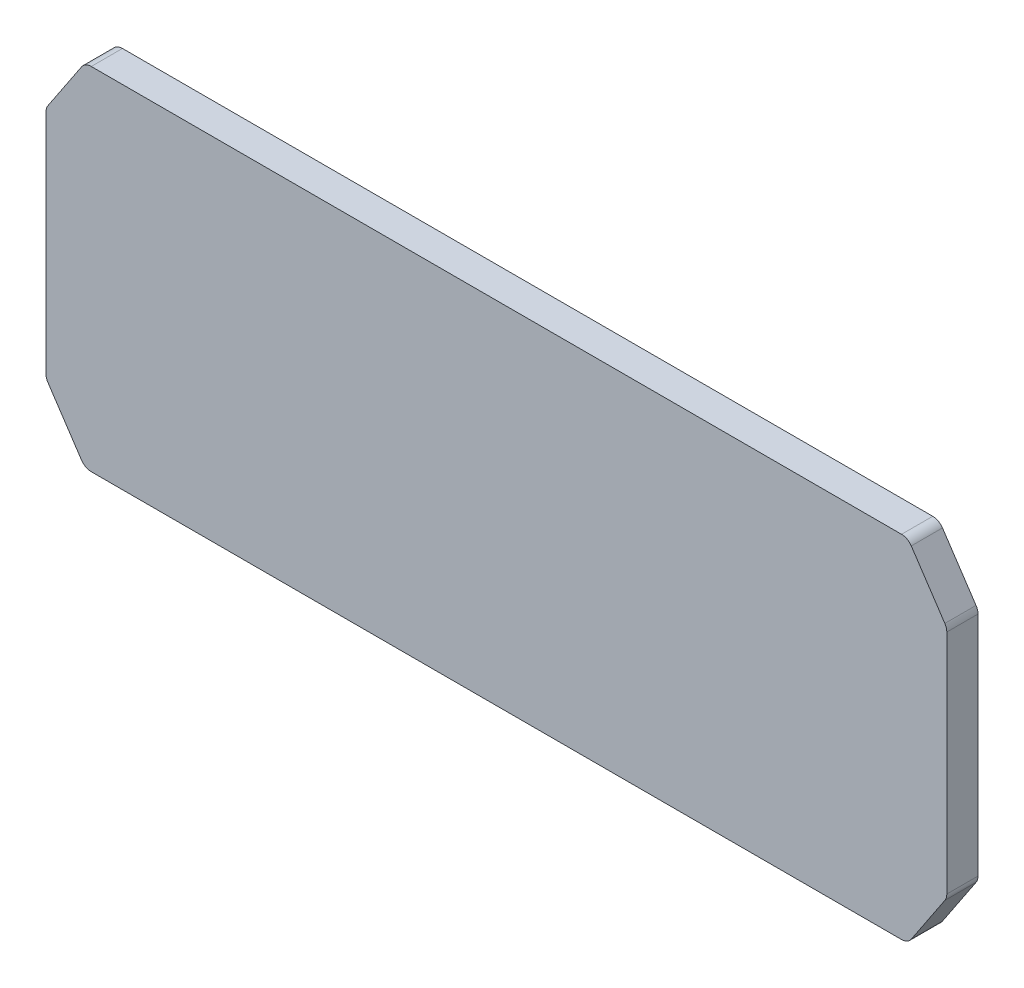
ISO-10303-21;
HEADER;
FILE_DESCRIPTION(('STEP AP214'),'2;1');
FILE_NAME('part.step','',(''),(''),'','','');
FILE_SCHEMA(('AUTOMOTIVE_DESIGN { 1 0 10303 214 1 1 1 1 }'));
ENDSEC;
DATA;
#1=APPLICATION_CONTEXT('core data for automotive mechanical design processes');
#2=APPLICATION_PROTOCOL_DEFINITION('international standard','automotive_design',2000,#1);
#3=PRODUCT_CONTEXT('',#1,'mechanical');
#4=PRODUCT('Part','Part','',(#3));
#5=PRODUCT_RELATED_PRODUCT_CATEGORY('part','',(#4));
#6=PRODUCT_DEFINITION_FORMATION('','',#4);
#7=PRODUCT_DEFINITION_CONTEXT('part definition',#1,'design');
#8=PRODUCT_DEFINITION('design','',#6,#7);
#9=PRODUCT_DEFINITION_SHAPE('','',#8);
#10=(LENGTH_UNIT() NAMED_UNIT(*) SI_UNIT(.MILLI.,.METRE.));
#11=(NAMED_UNIT(*) PLANE_ANGLE_UNIT() SI_UNIT($,.RADIAN.));
#12=(NAMED_UNIT(*) SI_UNIT($,.STERADIAN.) SOLID_ANGLE_UNIT());
#13=UNCERTAINTY_MEASURE_WITH_UNIT(LENGTH_MEASURE(1.E-05),#10,'distance_accuracy_value','');
#14=(GEOMETRIC_REPRESENTATION_CONTEXT(3) GLOBAL_UNCERTAINTY_ASSIGNED_CONTEXT((#13)) GLOBAL_UNIT_ASSIGNED_CONTEXT((#10,
#11,#12)) REPRESENTATION_CONTEXT('',''));
#15=CARTESIAN_POINT('',(0.,0.,0.));
#16=DIRECTION('',(0.,0.,1.));
#17=DIRECTION('',(1.,0.,0.));
#18=AXIS2_PLACEMENT_3D('',#15,#16,#17);
#19=CARTESIAN_POINT('',(103.894448724536,3.,8.00000000000045));
#20=DIRECTION('',(0.,0.,-1.));
#21=DIRECTION('',(-1.,0.,0.));
#22=AXIS2_PLACEMENT_3D('',#19,#20,#21);
#23=CYLINDRICAL_SURFACE('',#22,3.);
#24=CARTESIAN_POINT('',(103.894448724536,3.,4.44089209850063E-13));
#25=DIRECTION('',(0.,0.,1.));
#26=DIRECTION('',(-1.,0.,0.));
#27=AXIS2_PLACEMENT_3D('',#24,#25,#26);
#28=CIRCLE('',#27,3.);
#29=CARTESIAN_POINT('',(103.894448724536,-1.11022302462516E-13,6.66133814775094E-13));
#30=VERTEX_POINT('',#29);
#31=CARTESIAN_POINT('',(106.390599607549,1.33589941132406,2.22044604925031E-13));
#32=VERTEX_POINT('',#31);
#33=EDGE_CURVE('E183',#30,#32,#28,.T.);
#34=ORIENTED_EDGE('',*,*,#33,.T.);
#35=DIRECTION('',(0.,0.,-1.));
#36=VECTOR('',#35,1.);
#37=CARTESIAN_POINT('',(106.390599607549,1.33589941132428,8.00000000000045));
#38=LINE('',#37,#36);
#39=CARTESIAN_POINT('',(106.390599607549,1.33589941132428,8.00000000000045));
#40=VERTEX_POINT('',#39);
#41=EDGE_CURVE('E11',#40,#32,#38,.T.);
#42=ORIENTED_EDGE('',*,*,#41,.F.);
#43=CARTESIAN_POINT('',(103.894448724536,3.,8.00000000000045));
#44=DIRECTION('',(0.,0.,1.));
#45=DIRECTION('',(-1.,0.,0.));
#46=AXIS2_PLACEMENT_3D('',#43,#44,#45);
#47=CIRCLE('',#46,3.);
#48=CARTESIAN_POINT('',(103.894448724536,-3.33066907387547E-13,8.00000000000067));
#49=VERTEX_POINT('',#48);
#50=EDGE_CURVE('E213',#49,#40,#47,.T.);
#51=ORIENTED_EDGE('',*,*,#50,.F.);
#52=DIRECTION('',(0.,0.,-1.));
#53=VECTOR('',#52,1.);
#54=CARTESIAN_POINT('',(103.894448724536,-3.33066907387547E-13,8.00000000000067));
#55=LINE('',#54,#53);
#56=EDGE_CURVE('E179',#49,#30,#55,.T.);
#57=ORIENTED_EDGE('',*,*,#56,.T.);
#58=EDGE_LOOP('',(#34,#42,#51,#57));
#59=FACE_BOUND('',#58,.T.);
#60=ADVANCED_FACE('F39',(#59),#23,.T.);
#61=CARTESIAN_POINT('',(106.390599607549,1.33589941132428,8.00000000000045));
#62=DIRECTION('',(-0.832050294337843,0.554700196225229,0.));
#63=DIRECTION('',(-0.55470019622523,-0.832050294337843,0.));
#64=AXIS2_PLACEMENT_3D('',#61,#62,#63);
#65=PLANE('',#64);
#66=DIRECTION('',(0.55470019622523,0.832050294337843,0.));
#67=VECTOR('',#66,1.);
#68=CARTESIAN_POINT('',(106.390599607549,1.33589941132406,2.22044604925031E-13));
#69=LINE('',#68,#67);
#70=CARTESIAN_POINT('',(114.996150883013,14.2442263245203,4.44089209850063E-13));
#71=VERTEX_POINT('',#70);
#72=EDGE_CURVE('E186',#32,#71,#69,.T.);
#73=ORIENTED_EDGE('',*,*,#72,.T.);
#74=DIRECTION('',(0.,0.,-1.));
#75=VECTOR('',#74,1.);
#76=CARTESIAN_POINT('',(114.996150883013,14.2442263245206,8.0000000000009));
#77=LINE('',#76,#75);
#78=CARTESIAN_POINT('',(114.996150883013,14.2442263245206,8.0000000000009));
#79=VERTEX_POINT('',#78);
#80=EDGE_CURVE('E47',#79,#71,#77,.T.);
#81=ORIENTED_EDGE('',*,*,#80,.F.);
#82=DIRECTION('',(0.55470019622523,0.832050294337843,0.));
#83=VECTOR('',#82,1.);
#84=CARTESIAN_POINT('',(106.390599607549,1.33589941132428,8.00000000000045));
#85=LINE('',#84,#83);
#86=EDGE_CURVE('E122',#40,#79,#85,.T.);
#87=ORIENTED_EDGE('',*,*,#86,.F.);
#88=ORIENTED_EDGE('',*,*,#41,.T.);
#89=EDGE_LOOP('',(#73,#81,#87,#88));
#90=FACE_BOUND('',#89,.T.);
#91=ADVANCED_FACE('F311',(#90),#65,.F.);
#92=CARTESIAN_POINT('',(112.5,15.9083269131962,8.00000000000045));
#93=DIRECTION('',(0.,0.,-1.));
#94=DIRECTION('',(-1.,0.,0.));
#95=AXIS2_PLACEMENT_3D('',#92,#93,#94);
#96=CYLINDRICAL_SURFACE('',#95,3.00000000000001);
#97=CARTESIAN_POINT('',(112.5,15.9083269131964,8.88178419700125E-13));
#98=DIRECTION('',(0.,0.,1.));
#99=DIRECTION('',(1.,0.,0.));
#100=AXIS2_PLACEMENT_3D('',#97,#98,#99);
#101=CIRCLE('',#100,3.00000000000001);
#102=CARTESIAN_POINT('',(115.5,15.9083269131962,6.66133814775094E-13));
#103=VERTEX_POINT('',#102);
#104=EDGE_CURVE('E188',#71,#103,#101,.T.);
#105=ORIENTED_EDGE('',*,*,#104,.T.);
#106=DIRECTION('',(0.,0.,-1.));
#107=VECTOR('',#106,1.);
#108=CARTESIAN_POINT('',(115.5,15.9083269131963,8.00000000000045));
#109=LINE('',#108,#107);
#110=CARTESIAN_POINT('',(115.5,15.9083269131963,8.00000000000045));
#111=VERTEX_POINT('',#110);
#112=EDGE_CURVE('E244',#111,#103,#109,.T.);
#113=ORIENTED_EDGE('',*,*,#112,.F.);
#114=CARTESIAN_POINT('',(112.5,15.9083269131962,8.00000000000045));
#115=DIRECTION('',(0.,0.,1.));
#116=DIRECTION('',(1.,0.,0.));
#117=AXIS2_PLACEMENT_3D('',#114,#115,#116);
#118=CIRCLE('',#117,3.00000000000001);
#119=EDGE_CURVE('E252',#79,#111,#118,.T.);
#120=ORIENTED_EDGE('',*,*,#119,.F.);
#121=ORIENTED_EDGE('',*,*,#80,.T.);
#122=EDGE_LOOP('',(#105,#113,#120,#121));
#123=FACE_BOUND('',#122,.T.);
#124=ADVANCED_FACE('F250',(#123),#96,.T.);
#125=CARTESIAN_POINT('',(115.5,15.9083269131963,8.00000000000045));
#126=DIRECTION('',(-1.,0.,0.));
#127=DIRECTION('',(0.,-1.,0.));
#128=AXIS2_PLACEMENT_3D('',#125,#126,#127);
#129=PLANE('',#128);
#130=DIRECTION('',(0.,1.,0.));
#131=VECTOR('',#130,1.);
#132=CARTESIAN_POINT('',(115.5,15.9083269131962,6.66133814775094E-13));
#133=LINE('',#132,#131);
#134=CARTESIAN_POINT('',(115.5,74.0916730868043,6.66133814775094E-13));
#135=VERTEX_POINT('',#134);
#136=EDGE_CURVE('E190',#103,#135,#133,.T.);
#137=ORIENTED_EDGE('',*,*,#136,.T.);
#138=DIRECTION('',(0.,0.,-1.));
#139=VECTOR('',#138,1.);
#140=CARTESIAN_POINT('',(115.5,74.0916730868043,8.0000000000009));
#141=LINE('',#140,#139);
#142=CARTESIAN_POINT('',(115.5,74.0916730868043,8.0000000000009));
#143=VERTEX_POINT('',#142);
#144=EDGE_CURVE('E241',#143,#135,#141,.T.);
#145=ORIENTED_EDGE('',*,*,#144,.F.);
#146=DIRECTION('',(0.,1.,0.));
#147=VECTOR('',#146,1.);
#148=CARTESIAN_POINT('',(115.5,15.9083269131963,8.00000000000045));
#149=LINE('',#148,#147);
#150=EDGE_CURVE('E270',#111,#143,#149,.T.);
#151=ORIENTED_EDGE('',*,*,#150,.F.);
#152=ORIENTED_EDGE('',*,*,#112,.T.);
#153=EDGE_LOOP('',(#137,#145,#151,#152));
#154=FACE_BOUND('',#153,.T.);
#155=ADVANCED_FACE('F261',(#154),#129,.F.);
#156=CARTESIAN_POINT('',(112.5,74.0916730868043,8.0000000000009));
#157=DIRECTION('',(0.,0.,-1.));
#158=DIRECTION('',(-1.,0.,0.));
#159=AXIS2_PLACEMENT_3D('',#156,#157,#158);
#160=CYLINDRICAL_SURFACE('',#159,3.);
#161=CARTESIAN_POINT('',(112.5,74.091673086804,8.88178419700125E-13));
#162=DIRECTION('',(0.,0.,1.));
#163=DIRECTION('',(-1.,0.,0.));
#164=AXIS2_PLACEMENT_3D('',#161,#162,#163);
#165=CIRCLE('',#164,3.);
#166=CARTESIAN_POINT('',(114.996150883013,75.7557736754798,8.88178419700125E-13));
#167=VERTEX_POINT('',#166);
#168=EDGE_CURVE('E192',#135,#167,#165,.T.);
#169=ORIENTED_EDGE('',*,*,#168,.T.);
#170=DIRECTION('',(0.,0.,-1.));
#171=VECTOR('',#170,1.);
#172=CARTESIAN_POINT('',(114.996150883013,75.7557736754801,8.0000000000009));
#173=LINE('',#172,#171);
#174=CARTESIAN_POINT('',(114.996150883013,75.7557736754801,8.0000000000009));
#175=VERTEX_POINT('',#174);
#176=EDGE_CURVE('E238',#175,#167,#173,.T.);
#177=ORIENTED_EDGE('',*,*,#176,.F.);
#178=CARTESIAN_POINT('',(112.5,74.0916730868043,8.0000000000009));
#179=DIRECTION('',(0.,0.,1.));
#180=DIRECTION('',(-1.,0.,0.));
#181=AXIS2_PLACEMENT_3D('',#178,#179,#180);
#182=CIRCLE('',#181,3.);
#183=EDGE_CURVE('E267',#143,#175,#182,.T.);
#184=ORIENTED_EDGE('',*,*,#183,.F.);
#185=ORIENTED_EDGE('',*,*,#144,.T.);
#186=EDGE_LOOP('',(#169,#177,#184,#185));
#187=FACE_BOUND('',#186,.T.);
#188=ADVANCED_FACE('F265',(#187),#160,.T.);
#189=CARTESIAN_POINT('',(114.996150883013,75.7557736754801,8.0000000000009));
#190=DIRECTION('',(-0.832050294337844,-0.554700196225229,0.));
#191=DIRECTION('',(0.554700196225228,-0.832050294337844,0.));
#192=AXIS2_PLACEMENT_3D('',#189,#190,#191);
#193=PLANE('',#192);
#194=DIRECTION('',(-0.554700196225229,0.832050294337844,0.));
#195=VECTOR('',#194,1.);
#196=CARTESIAN_POINT('',(114.996150883014,75.7557736754798,8.88178419700125E-13));
#197=LINE('',#196,#195);
#198=CARTESIAN_POINT('',(106.39059960755,88.6641005886758,8.88178419700125E-13));
#199=VERTEX_POINT('',#198);
#200=EDGE_CURVE('E194',#167,#199,#197,.T.);
#201=ORIENTED_EDGE('',*,*,#200,.T.);
#202=DIRECTION('',(0.,0.,-1.));
#203=VECTOR('',#202,1.);
#204=CARTESIAN_POINT('',(106.390599607549,88.6641005886758,8.00000000000001));
#205=LINE('',#204,#203);
#206=CARTESIAN_POINT('',(106.390599607549,88.6641005886758,8.00000000000001));
#207=VERTEX_POINT('',#206);
#208=EDGE_CURVE('E235',#207,#199,#205,.T.);
#209=ORIENTED_EDGE('',*,*,#208,.F.);
#210=DIRECTION('',(-0.554700196225229,0.832050294337844,0.));
#211=VECTOR('',#210,1.);
#212=CARTESIAN_POINT('',(114.996150883013,75.7557736754801,8.0000000000009));
#213=LINE('',#212,#211);
#214=EDGE_CURVE('E269',#175,#207,#213,.T.);
#215=ORIENTED_EDGE('',*,*,#214,.F.);
#216=ORIENTED_EDGE('',*,*,#176,.T.);
#217=EDGE_LOOP('',(#201,#209,#215,#216));
#218=FACE_BOUND('',#217,.T.);
#219=ADVANCED_FACE('F324',(#218),#193,.F.);
#220=CARTESIAN_POINT('',(103.894448724536,87.0000000000001,8.00000000000045));
#221=DIRECTION('',(0.,0.,-1.));
#222=DIRECTION('',(-1.,0.,0.));
#223=AXIS2_PLACEMENT_3D('',#220,#221,#222);
#224=CYLINDRICAL_SURFACE('',#223,3.00000000000001);
#225=CARTESIAN_POINT('',(103.894448724536,87.0000000000001,2.22044604925031E-13));
#226=DIRECTION('',(0.,0.,1.));
#227=DIRECTION('',(1.,0.,0.));
#228=AXIS2_PLACEMENT_3D('',#225,#226,#227);
#229=CIRCLE('',#228,3.00000000000001);
#230=CARTESIAN_POINT('',(103.894448724536,89.9999999999997,4.44089209850063E-13));
#231=VERTEX_POINT('',#230);
#232=EDGE_CURVE('E196',#199,#231,#229,.T.);
#233=ORIENTED_EDGE('',*,*,#232,.T.);
#234=DIRECTION('',(0.,0.,-1.));
#235=VECTOR('',#234,1.);
#236=CARTESIAN_POINT('',(103.894448724536,90.,8.00000000000067));
#237=LINE('',#236,#235);
#238=CARTESIAN_POINT('',(103.894448724536,90.,8.00000000000067));
#239=VERTEX_POINT('',#238);
#240=EDGE_CURVE('E232',#239,#231,#237,.T.);
#241=ORIENTED_EDGE('',*,*,#240,.F.);
#242=CARTESIAN_POINT('',(103.894448724536,87.0000000000001,8.00000000000045));
#243=DIRECTION('',(0.,0.,1.));
#244=DIRECTION('',(1.,0.,0.));
#245=AXIS2_PLACEMENT_3D('',#242,#243,#244);
#246=CIRCLE('',#245,3.00000000000001);
#247=EDGE_CURVE('E272',#207,#239,#246,.T.);
#248=ORIENTED_EDGE('',*,*,#247,.F.);
#249=ORIENTED_EDGE('',*,*,#208,.T.);
#250=EDGE_LOOP('',(#233,#241,#248,#249));
#251=FACE_BOUND('',#250,.T.);
#252=ADVANCED_FACE('F327',(#251),#224,.T.);
#253=CARTESIAN_POINT('',(-103.894448724536,89.9999999999999,8.0000000000009));
#254=DIRECTION('',(0.,-1.,0.));
#255=DIRECTION('',(0.,0.,-1.));
#256=AXIS2_PLACEMENT_3D('',#253,#254,#255);
#257=PLANE('',#256);
#258=DIRECTION('',(-1.,0.,0.));
#259=VECTOR('',#258,1.);
#260=CARTESIAN_POINT('',(-103.894448724536,89.9999999999997,4.44089209850063E-13));
#261=LINE('',#260,#259);
#262=CARTESIAN_POINT('',(-103.894448724536,89.9999999999997,4.44089209850063E-13));
#263=VERTEX_POINT('',#262);
#264=EDGE_CURVE('E198',#231,#263,#261,.T.);
#265=ORIENTED_EDGE('',*,*,#264,.T.);
#266=DIRECTION('',(0.,0.,-1.));
#267=VECTOR('',#266,1.);
#268=CARTESIAN_POINT('',(-103.894448724536,89.9999999999999,8.0000000000009));
#269=LINE('',#268,#267);
#270=CARTESIAN_POINT('',(-103.894448724536,89.9999999999999,8.0000000000009));
#271=VERTEX_POINT('',#270);
#272=EDGE_CURVE('E229',#271,#263,#269,.T.);
#273=ORIENTED_EDGE('',*,*,#272,.F.);
#274=DIRECTION('',(-1.,0.,0.));
#275=VECTOR('',#274,1.);
#276=CARTESIAN_POINT('',(-103.894448724536,89.9999999999999,8.0000000000009));
#277=LINE('',#276,#275);
#278=EDGE_CURVE('E278',#239,#271,#277,.T.);
#279=ORIENTED_EDGE('',*,*,#278,.F.);
#280=ORIENTED_EDGE('',*,*,#240,.T.);
#281=EDGE_LOOP('',(#265,#273,#279,#280));
#282=FACE_BOUND('',#281,.T.);
#283=ADVANCED_FACE('F331',(#282),#257,.F.);
#284=CARTESIAN_POINT('',(-103.894448724536,87.0000000000001,8.00000000000045));
#285=DIRECTION('',(0.,0.,-1.));
#286=DIRECTION('',(-1.,0.,0.));
#287=AXIS2_PLACEMENT_3D('',#284,#285,#286);
#288=CYLINDRICAL_SURFACE('',#287,3.00000000000001);
#289=CARTESIAN_POINT('',(-103.894448724536,86.9999999999999,4.44089209850063E-13));
#290=DIRECTION('',(0.,0.,1.));
#291=DIRECTION('',(-1.,0.,0.));
#292=AXIS2_PLACEMENT_3D('',#289,#290,#291);
#293=CIRCLE('',#292,3.00000000000001);
#294=CARTESIAN_POINT('',(-106.39059960755,88.6641005886758,8.88178419700125E-13));
#295=VERTEX_POINT('',#294);
#296=EDGE_CURVE('E200',#263,#295,#293,.T.);
#297=ORIENTED_EDGE('',*,*,#296,.T.);
#298=DIRECTION('',(0.,0.,-1.));
#299=VECTOR('',#298,1.);
#300=CARTESIAN_POINT('',(-106.39059960755,88.6641005886758,8.00000000000045));
#301=LINE('',#300,#299);
#302=CARTESIAN_POINT('',(-106.39059960755,88.6641005886758,8.00000000000045));
#303=VERTEX_POINT('',#302);
#304=EDGE_CURVE('E226',#303,#295,#301,.T.);
#305=ORIENTED_EDGE('',*,*,#304,.F.);
#306=CARTESIAN_POINT('',(-103.894448724536,87.0000000000001,8.00000000000045));
#307=DIRECTION('',(0.,0.,1.));
#308=DIRECTION('',(-1.,0.,0.));
#309=AXIS2_PLACEMENT_3D('',#306,#307,#308);
#310=CIRCLE('',#309,3.00000000000001);
#311=EDGE_CURVE('E280',#271,#303,#310,.T.);
#312=ORIENTED_EDGE('',*,*,#311,.F.);
#313=ORIENTED_EDGE('',*,*,#272,.T.);
#314=EDGE_LOOP('',(#297,#305,#312,#313));
#315=FACE_BOUND('',#314,.T.);
#316=ADVANCED_FACE('F335',(#315),#288,.T.);
#317=CARTESIAN_POINT('',(-114.996150883014,75.7557736754799,8.00000000000067));
#318=DIRECTION('',(0.832050294337844,-0.554700196225228,0.));
#319=DIRECTION('',(0.554700196225229,0.832050294337844,0.));
#320=AXIS2_PLACEMENT_3D('',#317,#318,#319);
#321=PLANE('',#320);
#322=DIRECTION('',(-0.554700196225229,-0.832050294337844,0.));
#323=VECTOR('',#322,1.);
#324=CARTESIAN_POINT('',(-114.996150883014,75.7557736754795,6.66133814775094E-13));
#325=LINE('',#324,#323);
#326=CARTESIAN_POINT('',(-114.996150883014,75.7557736754795,6.66133814775094E-13));
#327=VERTEX_POINT('',#326);
#328=EDGE_CURVE('E202',#295,#327,#325,.T.);
#329=ORIENTED_EDGE('',*,*,#328,.T.);
#330=DIRECTION('',(0.,0.,-1.));
#331=VECTOR('',#330,1.);
#332=CARTESIAN_POINT('',(-114.996150883014,75.7557736754799,8.00000000000067));
#333=LINE('',#332,#331);
#334=CARTESIAN_POINT('',(-114.996150883014,75.7557736754799,8.00000000000067));
#335=VERTEX_POINT('',#334);
#336=EDGE_CURVE('E223',#335,#327,#333,.T.);
#337=ORIENTED_EDGE('',*,*,#336,.F.);
#338=DIRECTION('',(-0.554700196225229,-0.832050294337844,0.));
#339=VECTOR('',#338,1.);
#340=CARTESIAN_POINT('',(-114.996150883014,75.7557736754799,8.00000000000067));
#341=LINE('',#340,#339);
#342=EDGE_CURVE('E282',#303,#335,#341,.T.);
#343=ORIENTED_EDGE('',*,*,#342,.F.);
#344=ORIENTED_EDGE('',*,*,#304,.T.);
#345=EDGE_LOOP('',(#329,#337,#343,#344));
#346=FACE_BOUND('',#345,.T.);
#347=ADVANCED_FACE('F339',(#346),#321,.F.);
#348=CARTESIAN_POINT('',(-112.5,74.0916730868038,8.00000000000112));
#349=DIRECTION('',(0.,0.,-1.));
#350=DIRECTION('',(-1.,0.,0.));
#351=AXIS2_PLACEMENT_3D('',#348,#349,#350);
#352=CYLINDRICAL_SURFACE('',#351,3.);
#353=CARTESIAN_POINT('',(-112.5,74.0916730868042,8.88178419700125E-13));
#354=DIRECTION('',(0.,0.,1.));
#355=DIRECTION('',(1.,0.,0.));
#356=AXIS2_PLACEMENT_3D('',#353,#354,#355);
#357=CIRCLE('',#356,3.);
#358=CARTESIAN_POINT('',(-115.5,74.0916730868042,8.88178419700125E-13));
#359=VERTEX_POINT('',#358);
#360=EDGE_CURVE('E204',#327,#359,#357,.T.);
#361=ORIENTED_EDGE('',*,*,#360,.T.);
#362=DIRECTION('',(0.,0.,-1.));
#363=VECTOR('',#362,1.);
#364=CARTESIAN_POINT('',(-115.5,74.0916730868043,8.0000000000009));
#365=LINE('',#364,#363);
#366=CARTESIAN_POINT('',(-115.5,74.0916730868043,8.0000000000009));
#367=VERTEX_POINT('',#366);
#368=EDGE_CURVE('E220',#367,#359,#365,.T.);
#369=ORIENTED_EDGE('',*,*,#368,.F.);
#370=CARTESIAN_POINT('',(-112.5,74.0916730868038,8.00000000000112));
#371=DIRECTION('',(0.,0.,1.));
#372=DIRECTION('',(1.,0.,0.));
#373=AXIS2_PLACEMENT_3D('',#370,#371,#372);
#374=CIRCLE('',#373,3.);
#375=EDGE_CURVE('E284',#335,#367,#374,.T.);
#376=ORIENTED_EDGE('',*,*,#375,.F.);
#377=ORIENTED_EDGE('',*,*,#336,.T.);
#378=EDGE_LOOP('',(#361,#369,#376,#377));
#379=FACE_BOUND('',#378,.T.);
#380=ADVANCED_FACE('F343',(#379),#352,.T.);
#381=CARTESIAN_POINT('',(-115.5,15.908326913196,8.00000000000045));
#382=DIRECTION('',(1.,0.,0.));
#383=DIRECTION('',(0.,1.,0.));
#384=AXIS2_PLACEMENT_3D('',#381,#382,#383);
#385=PLANE('',#384);
#386=DIRECTION('',(0.,-1.,0.));
#387=VECTOR('',#386,1.);
#388=CARTESIAN_POINT('',(-115.5,15.9083269131962,6.66133814775094E-13));
#389=LINE('',#388,#387);
#390=CARTESIAN_POINT('',(-115.5,15.9083269131962,6.66133814775094E-13));
#391=VERTEX_POINT('',#390);
#392=EDGE_CURVE('E206',#359,#391,#389,.T.);
#393=ORIENTED_EDGE('',*,*,#392,.T.);
#394=DIRECTION('',(0.,0.,-1.));
#395=VECTOR('',#394,1.);
#396=CARTESIAN_POINT('',(-115.5,15.908326913196,8.00000000000045));
#397=LINE('',#396,#395);
#398=CARTESIAN_POINT('',(-115.5,15.908326913196,8.00000000000045));
#399=VERTEX_POINT('',#398);
#400=EDGE_CURVE('E217',#399,#391,#397,.T.);
#401=ORIENTED_EDGE('',*,*,#400,.F.);
#402=DIRECTION('',(0.,-1.,0.));
#403=VECTOR('',#402,1.);
#404=CARTESIAN_POINT('',(-115.5,15.908326913196,8.00000000000045));
#405=LINE('',#404,#403);
#406=EDGE_CURVE('E286',#367,#399,#405,.T.);
#407=ORIENTED_EDGE('',*,*,#406,.F.);
#408=ORIENTED_EDGE('',*,*,#368,.T.);
#409=EDGE_LOOP('',(#393,#401,#407,#408));
#410=FACE_BOUND('',#409,.T.);
#411=ADVANCED_FACE('F292',(#410),#385,.F.);
#412=CARTESIAN_POINT('',(-112.5,15.9083269131963,8.0000000000009));
#413=DIRECTION('',(0.,0.,-1.));
#414=DIRECTION('',(-1.,0.,0.));
#415=AXIS2_PLACEMENT_3D('',#412,#413,#414);
#416=CYLINDRICAL_SURFACE('',#415,3.00000000000001);
#417=CARTESIAN_POINT('',(-112.5,15.9083269131962,6.66133814775094E-13));
#418=DIRECTION('',(0.,0.,1.));
#419=DIRECTION('',(-1.,0.,0.));
#420=AXIS2_PLACEMENT_3D('',#417,#418,#419);
#421=CIRCLE('',#420,3.00000000000001);
#422=CARTESIAN_POINT('',(-114.996150883014,14.2442263245203,4.44089209850063E-13));
#423=VERTEX_POINT('',#422);
#424=EDGE_CURVE('E208',#391,#423,#421,.T.);
#425=ORIENTED_EDGE('',*,*,#424,.T.);
#426=DIRECTION('',(0.,0.,-1.));
#427=VECTOR('',#426,1.);
#428=CARTESIAN_POINT('',(-114.996150883014,14.2442263245203,8.0000000000009));
#429=LINE('',#428,#427);
#430=CARTESIAN_POINT('',(-114.996150883014,14.2442263245203,8.0000000000009));
#431=VERTEX_POINT('',#430);
#432=EDGE_CURVE('E174',#431,#423,#429,.T.);
#433=ORIENTED_EDGE('',*,*,#432,.F.);
#434=CARTESIAN_POINT('',(-112.5,15.9083269131963,8.0000000000009));
#435=DIRECTION('',(0.,0.,1.));
#436=DIRECTION('',(-1.,0.,0.));
#437=AXIS2_PLACEMENT_3D('',#434,#435,#436);
#438=CIRCLE('',#437,3.00000000000001);
#439=EDGE_CURVE('E165',#399,#431,#438,.T.);
#440=ORIENTED_EDGE('',*,*,#439,.F.);
#441=ORIENTED_EDGE('',*,*,#400,.T.);
#442=EDGE_LOOP('',(#425,#433,#440,#441));
#443=FACE_BOUND('',#442,.T.);
#444=ADVANCED_FACE('F296',(#443),#416,.T.);
#445=CARTESIAN_POINT('',(-106.39059960755,1.33589941132428,8.00000000000067));
#446=DIRECTION('',(0.832050294337843,0.55470019622523,0.));
#447=DIRECTION('',(-0.55470019622523,0.832050294337843,0.));
#448=AXIS2_PLACEMENT_3D('',#445,#446,#447);
#449=PLANE('',#448);
#450=DIRECTION('',(0.55470019622523,-0.832050294337843,0.));
#451=VECTOR('',#450,1.);
#452=CARTESIAN_POINT('',(-106.39059960755,1.33589941132428,1.11022302462516E-12));
#453=LINE('',#452,#451);
#454=CARTESIAN_POINT('',(-106.39059960755,1.33589941132428,1.11022302462516E-12));
#455=VERTEX_POINT('',#454);
#456=EDGE_CURVE('E173',#423,#455,#453,.T.);
#457=ORIENTED_EDGE('',*,*,#456,.T.);
#458=DIRECTION('',(0.,0.,-1.));
#459=VECTOR('',#458,1.);
#460=CARTESIAN_POINT('',(-106.39059960755,1.33589941132428,8.00000000000067));
#461=LINE('',#460,#459);
#462=CARTESIAN_POINT('',(-106.39059960755,1.33589941132428,8.00000000000067));
#463=VERTEX_POINT('',#462);
#464=EDGE_CURVE('E170',#463,#455,#461,.T.);
#465=ORIENTED_EDGE('',*,*,#464,.F.);
#466=DIRECTION('',(0.55470019622523,-0.832050294337843,0.));
#467=VECTOR('',#466,1.);
#468=CARTESIAN_POINT('',(-106.39059960755,1.33589941132428,8.00000000000067));
#469=LINE('',#468,#467);
#470=EDGE_CURVE('E159',#431,#463,#469,.T.);
#471=ORIENTED_EDGE('',*,*,#470,.F.);
#472=ORIENTED_EDGE('',*,*,#432,.T.);
#473=EDGE_LOOP('',(#457,#465,#471,#472));
#474=FACE_BOUND('',#473,.T.);
#475=ADVANCED_FACE('F171',(#474),#449,.F.);
#476=CARTESIAN_POINT('',(-103.894448724536,2.99999999999978,8.00000000000067));
#477=DIRECTION('',(0.,0.,-1.));
#478=DIRECTION('',(-1.,0.,0.));
#479=AXIS2_PLACEMENT_3D('',#476,#477,#478);
#480=CYLINDRICAL_SURFACE('',#479,3.);
#481=CARTESIAN_POINT('',(-103.894448724536,3.,4.44089209850063E-13));
#482=DIRECTION('',(0.,0.,1.));
#483=DIRECTION('',(1.,0.,0.));
#484=AXIS2_PLACEMENT_3D('',#481,#482,#483);
#485=CIRCLE('',#484,3.);
#486=CARTESIAN_POINT('',(-103.894448724536,1.11022302462516E-13,6.66133814775094E-13));
#487=VERTEX_POINT('',#486);
#488=EDGE_CURVE('E108',#455,#487,#485,.T.);
#489=ORIENTED_EDGE('',*,*,#488,.T.);
#490=DIRECTION('',(0.,0.,-1.));
#491=VECTOR('',#490,1.);
#492=CARTESIAN_POINT('',(-103.894448724536,-2.22044604925031E-13,8.00000000000067));
#493=LINE('',#492,#491);
#494=CARTESIAN_POINT('',(-103.894448724536,-2.22044604925031E-13,8.00000000000067));
#495=VERTEX_POINT('',#494);
#496=EDGE_CURVE('E175',#495,#487,#493,.T.);
#497=ORIENTED_EDGE('',*,*,#496,.F.);
#498=CARTESIAN_POINT('',(-103.894448724536,2.99999999999978,8.00000000000067));
#499=DIRECTION('',(0.,0.,1.));
#500=DIRECTION('',(1.,0.,0.));
#501=AXIS2_PLACEMENT_3D('',#498,#499,#500);
#502=CIRCLE('',#501,3.);
#503=EDGE_CURVE('E163',#463,#495,#502,.T.);
#504=ORIENTED_EDGE('',*,*,#503,.F.);
#505=ORIENTED_EDGE('',*,*,#464,.T.);
#506=EDGE_LOOP('',(#489,#497,#504,#505));
#507=FACE_BOUND('',#506,.T.);
#508=ADVANCED_FACE('F177',(#507),#480,.T.);
#509=CARTESIAN_POINT('',(-103.894448724536,-2.22044604925031E-13,8.00000000000067));
#510=DIRECTION('',(0.,1.,0.));
#511=DIRECTION('',(0.,0.,1.));
#512=AXIS2_PLACEMENT_3D('',#509,#510,#511);
#513=PLANE('',#512);
#514=DIRECTION('',(1.,0.,0.));
#515=VECTOR('',#514,1.);
#516=CARTESIAN_POINT('',(-103.894448724536,1.11022302462516E-13,6.66133814775094E-13));
#517=LINE('',#516,#515);
#518=EDGE_CURVE('E114',#487,#30,#517,.T.);
#519=ORIENTED_EDGE('',*,*,#518,.T.);
#520=ORIENTED_EDGE('',*,*,#56,.F.);
#521=DIRECTION('',(1.,0.,0.));
#522=VECTOR('',#521,1.);
#523=CARTESIAN_POINT('',(-103.894448724536,-2.22044604925031E-13,8.00000000000067));
#524=LINE('',#523,#522);
#525=EDGE_CURVE('E55',#495,#49,#524,.T.);
#526=ORIENTED_EDGE('',*,*,#525,.F.);
#527=ORIENTED_EDGE('',*,*,#496,.T.);
#528=EDGE_LOOP('',(#519,#520,#526,#527));
#529=FACE_BOUND('',#528,.T.);
#530=ADVANCED_FACE('F300',(#529),#513,.F.);
#531=CARTESIAN_POINT('',(103.894448724536,3.,8.00000000000045));
#532=DIRECTION('',(0.,0.,-1.));
#533=DIRECTION('',(-1.,0.,0.));
#534=AXIS2_PLACEMENT_3D('',#531,#532,#533);
#535=PLANE('',#534);
#536=ORIENTED_EDGE('',*,*,#50,.T.);
#537=ORIENTED_EDGE('',*,*,#86,.T.);
#538=ORIENTED_EDGE('',*,*,#119,.T.);
#539=ORIENTED_EDGE('',*,*,#150,.T.);
#540=ORIENTED_EDGE('',*,*,#183,.T.);
#541=ORIENTED_EDGE('',*,*,#214,.T.);
#542=ORIENTED_EDGE('',*,*,#247,.T.);
#543=ORIENTED_EDGE('',*,*,#278,.T.);
#544=ORIENTED_EDGE('',*,*,#311,.T.);
#545=ORIENTED_EDGE('',*,*,#342,.T.);
#546=ORIENTED_EDGE('',*,*,#375,.T.);
#547=ORIENTED_EDGE('',*,*,#406,.T.);
#548=ORIENTED_EDGE('',*,*,#439,.T.);
#549=ORIENTED_EDGE('',*,*,#470,.T.);
#550=ORIENTED_EDGE('',*,*,#503,.T.);
#551=ORIENTED_EDGE('',*,*,#525,.T.);
#552=EDGE_LOOP('',(#536,#537,#538,#539,#540,#541,#542,#543,#544,#545,#546,#547,#548,#549,#550,#551));
#553=FACE_BOUND('',#552,.T.);
#554=ADVANCED_FACE('F161',(#553),#535,.F.);
#555=CARTESIAN_POINT('',(103.894448724536,3.,4.44089209850063E-13));
#556=DIRECTION('',(0.,0.,-1.));
#557=DIRECTION('',(-1.,0.,0.));
#558=AXIS2_PLACEMENT_3D('',#555,#556,#557);
#559=PLANE('',#558);
#560=ORIENTED_EDGE('',*,*,#33,.F.);
#561=ORIENTED_EDGE('',*,*,#518,.F.);
#562=ORIENTED_EDGE('',*,*,#488,.F.);
#563=ORIENTED_EDGE('',*,*,#456,.F.);
#564=ORIENTED_EDGE('',*,*,#424,.F.);
#565=ORIENTED_EDGE('',*,*,#392,.F.);
#566=ORIENTED_EDGE('',*,*,#360,.F.);
#567=ORIENTED_EDGE('',*,*,#328,.F.);
#568=ORIENTED_EDGE('',*,*,#296,.F.);
#569=ORIENTED_EDGE('',*,*,#264,.F.);
#570=ORIENTED_EDGE('',*,*,#232,.F.);
#571=ORIENTED_EDGE('',*,*,#200,.F.);
#572=ORIENTED_EDGE('',*,*,#168,.F.);
#573=ORIENTED_EDGE('',*,*,#136,.F.);
#574=ORIENTED_EDGE('',*,*,#104,.F.);
#575=ORIENTED_EDGE('',*,*,#72,.F.);
#576=EDGE_LOOP('',(#560,#561,#562,#563,#564,#565,#566,#567,#568,#569,#570,#571,#572,#573,#574,#575));
#577=FACE_BOUND('',#576,.T.);
#578=ADVANCED_FACE('F256',(#577),#559,.T.);
#579=CLOSED_SHELL('',(#60,#91,#124,#155,#188,#219,#252,#283,#316,#347,#380,#411,#444,#475,#508,
#530,#554,#578));
#580=MANIFOLD_SOLID_BREP('B2',#579);
#581=ADVANCED_BREP_SHAPE_REPRESENTATION('',(#18,#580),#14);
#582=SHAPE_DEFINITION_REPRESENTATION(#9,#581);
ENDSEC;
END-ISO-10303-21;
